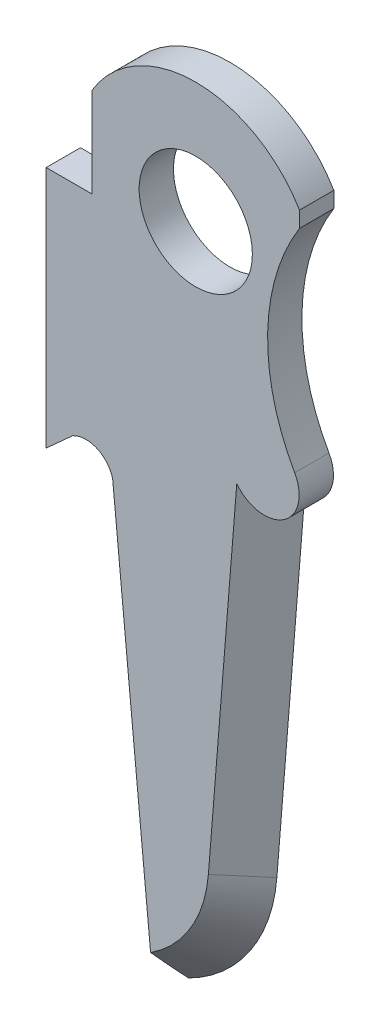
ISO-10303-21;
HEADER;
FILE_DESCRIPTION(('STEP AP214'),'2;1');
FILE_NAME('part.step','',(''),(''),'','','');
FILE_SCHEMA(('AUTOMOTIVE_DESIGN { 1 0 10303 214 1 1 1 1 }'));
ENDSEC;
DATA;
#1=APPLICATION_CONTEXT('core data for automotive mechanical design processes');
#2=APPLICATION_PROTOCOL_DEFINITION('international standard','automotive_design',2000,#1);
#3=PRODUCT_CONTEXT('',#1,'mechanical');
#4=PRODUCT('Part','Part','',(#3));
#5=PRODUCT_RELATED_PRODUCT_CATEGORY('part','',(#4));
#6=PRODUCT_DEFINITION_FORMATION('','',#4);
#7=PRODUCT_DEFINITION_CONTEXT('part definition',#1,'design');
#8=PRODUCT_DEFINITION('design','',#6,#7);
#9=PRODUCT_DEFINITION_SHAPE('','',#8);
#10=(LENGTH_UNIT() NAMED_UNIT(*) SI_UNIT(.MILLI.,.METRE.));
#11=(NAMED_UNIT(*) PLANE_ANGLE_UNIT() SI_UNIT($,.RADIAN.));
#12=(NAMED_UNIT(*) SI_UNIT($,.STERADIAN.) SOLID_ANGLE_UNIT());
#13=UNCERTAINTY_MEASURE_WITH_UNIT(LENGTH_MEASURE(1.E-05),#10,'distance_accuracy_value','');
#14=(GEOMETRIC_REPRESENTATION_CONTEXT(3) GLOBAL_UNCERTAINTY_ASSIGNED_CONTEXT((#13)) GLOBAL_UNIT_ASSIGNED_CONTEXT((#10,
#11,#12)) REPRESENTATION_CONTEXT('',''));
#15=CARTESIAN_POINT('',(0.,0.,0.));
#16=DIRECTION('',(0.,0.,1.));
#17=DIRECTION('',(1.,0.,0.));
#18=AXIS2_PLACEMENT_3D('',#15,#16,#17);
#19=CARTESIAN_POINT('',(41.3460783074005,38.2231152673054,1.27));
#20=DIRECTION('',(0.,-1.,0.));
#21=DIRECTION('',(0.,0.,-1.));
#22=AXIS2_PLACEMENT_3D('',#19,#20,#21);
#23=PLANE('',#22);
#24=DIRECTION('',(-1.,0.,0.));
#25=VECTOR('',#24,1.);
#26=CARTESIAN_POINT('',(41.3460783074005,38.2231152673054,0.));
#27=LINE('',#26,#25);
#28=CARTESIAN_POINT('',(43.0415755390958,38.2231152673054,0.));
#29=VERTEX_POINT('',#28);
#30=CARTESIAN_POINT('',(41.3460783074005,38.2231152673054,0.));
#31=VERTEX_POINT('',#30);
#32=EDGE_CURVE('E163',#29,#31,#27,.T.);
#33=ORIENTED_EDGE('',*,*,#32,.T.);
#34=DIRECTION('',(0.,0.,-1.));
#35=VECTOR('',#34,1.);
#36=CARTESIAN_POINT('',(41.3460783074005,38.2231152673054,1.27));
#37=LINE('',#36,#35);
#38=CARTESIAN_POINT('',(41.3460783074005,38.2231152673054,1.27));
#39=VERTEX_POINT('',#38);
#40=EDGE_CURVE('E141',#39,#31,#37,.T.);
#41=ORIENTED_EDGE('',*,*,#40,.F.);
#42=DIRECTION('',(-1.,0.,0.));
#43=VECTOR('',#42,1.);
#44=CARTESIAN_POINT('',(41.3460783074005,38.2231152673054,1.27));
#45=LINE('',#44,#43);
#46=CARTESIAN_POINT('',(43.0415755390958,38.2231152673054,1.27));
#47=VERTEX_POINT('',#46);
#48=EDGE_CURVE('E149',#47,#39,#45,.T.);
#49=ORIENTED_EDGE('',*,*,#48,.F.);
#50=DIRECTION('',(0.,0.,-1.));
#51=VECTOR('',#50,1.);
#52=CARTESIAN_POINT('',(43.0415755390958,38.2231152673054,1.27));
#53=LINE('',#52,#51);
#54=EDGE_CURVE('E391',#47,#29,#53,.T.);
#55=ORIENTED_EDGE('',*,*,#54,.T.);
#56=EDGE_LOOP('',(#33,#41,#49,#55));
#57=FACE_BOUND('',#56,.T.);
#58=ADVANCED_FACE('F45',(#57),#23,.F.);
#59=CARTESIAN_POINT('',(41.3460783074005,38.2231152673054,1.27));
#60=DIRECTION('',(1.,0.,0.));
#61=DIRECTION('',(0.,1.,0.));
#62=AXIS2_PLACEMENT_3D('',#59,#60,#61);
#63=PLANE('',#62);
#64=DIRECTION('',(0.,-1.,0.));
#65=VECTOR('',#64,1.);
#66=CARTESIAN_POINT('',(41.3460783074005,38.2231152673054,0.));
#67=LINE('',#66,#65);
#68=CARTESIAN_POINT('',(41.3460783074005,29.2269843527848,0.));
#69=VERTEX_POINT('',#68);
#70=EDGE_CURVE('E394',#31,#69,#67,.T.);
#71=ORIENTED_EDGE('',*,*,#70,.T.);
#72=DIRECTION('',(0.,0.,-1.));
#73=VECTOR('',#72,1.);
#74=CARTESIAN_POINT('',(41.3460783074005,29.2269843527848,1.27));
#75=LINE('',#74,#73);
#76=CARTESIAN_POINT('',(41.3460783074005,29.2269843527848,1.27));
#77=VERTEX_POINT('',#76);
#78=EDGE_CURVE('E144',#77,#69,#75,.T.);
#79=ORIENTED_EDGE('',*,*,#78,.F.);
#80=DIRECTION('',(0.,-1.,0.));
#81=VECTOR('',#80,1.);
#82=CARTESIAN_POINT('',(41.3460783074005,38.2231152673054,1.27));
#83=LINE('',#82,#81);
#84=EDGE_CURVE('E137',#39,#77,#83,.T.);
#85=ORIENTED_EDGE('',*,*,#84,.F.);
#86=ORIENTED_EDGE('',*,*,#40,.T.);
#87=EDGE_LOOP('',(#71,#79,#85,#86));
#88=FACE_BOUND('',#87,.T.);
#89=ADVANCED_FACE('F139',(#88),#63,.F.);
#90=CARTESIAN_POINT('',(41.3460783074005,29.2269843527848,1.27));
#91=DIRECTION('',(-0.671382027774461,0.74111144423862,0.));
#92=DIRECTION('',(-0.74111144423862,-0.671382027774461,0.));
#93=AXIS2_PLACEMENT_3D('',#90,#91,#92);
#94=PLANE('',#93);
#95=DIRECTION('',(0.74111144423862,0.671382027774461,0.));
#96=VECTOR('',#95,1.);
#97=CARTESIAN_POINT('',(41.3460783074005,29.2269843527848,0.));
#98=LINE('',#97,#96);
#99=CARTESIAN_POINT('',(42.3274094224322,30.1159843527848,0.));
#100=VERTEX_POINT('',#99);
#101=EDGE_CURVE('E398',#69,#100,#98,.T.);
#102=ORIENTED_EDGE('',*,*,#101,.T.);
#103=DIRECTION('',(0.,0.,-1.));
#104=VECTOR('',#103,1.);
#105=CARTESIAN_POINT('',(42.3274094224322,30.1159843527848,1.27));
#106=LINE('',#105,#104);
#107=CARTESIAN_POINT('',(42.3274094224322,30.1159843527848,1.27));
#108=VERTEX_POINT('',#107);
#109=EDGE_CURVE('E173',#108,#100,#106,.T.);
#110=ORIENTED_EDGE('',*,*,#109,.F.);
#111=DIRECTION('',(0.74111144423862,0.671382027774461,0.));
#112=VECTOR('',#111,1.);
#113=CARTESIAN_POINT('',(41.3460783074005,29.2269843527848,1.27));
#114=LINE('',#113,#112);
#115=EDGE_CURVE('E148',#77,#108,#114,.T.);
#116=ORIENTED_EDGE('',*,*,#115,.F.);
#117=ORIENTED_EDGE('',*,*,#78,.T.);
#118=EDGE_LOOP('',(#102,#110,#116,#117));
#119=FACE_BOUND('',#118,.T.);
#120=ADVANCED_FACE('F201',(#119),#94,.F.);
#121=CARTESIAN_POINT('',(42.8192783074005,29.2269843527848,1.27));
#122=DIRECTION('',(0.,0.,-1.));
#123=DIRECTION('',(-1.,0.,0.));
#124=AXIS2_PLACEMENT_3D('',#121,#122,#123);
#125=CYLINDRICAL_SURFACE('',#124,1.016);
#126=CARTESIAN_POINT('',(42.8192783074005,29.2269843527848,0.));
#127=DIRECTION('',(0.,0.,-1.));
#128=DIRECTION('',(1.,0.,0.));
#129=AXIS2_PLACEMENT_3D('',#126,#127,#128);
#130=CIRCLE('',#129,1.016);
#131=CARTESIAN_POINT('',(43.8092268111117,29.4555843527848,0.));
#132=VERTEX_POINT('',#131);
#133=EDGE_CURVE('E401',#100,#132,#130,.T.);
#134=ORIENTED_EDGE('',*,*,#133,.T.);
#135=DIRECTION('',(0.,0.,-1.));
#136=VECTOR('',#135,1.);
#137=CARTESIAN_POINT('',(43.8092268111117,29.4555843527848,1.27));
#138=LINE('',#137,#136);
#139=CARTESIAN_POINT('',(43.8092268111117,29.4555843527848,1.27));
#140=VERTEX_POINT('',#139);
#141=EDGE_CURVE('E443',#140,#132,#138,.T.);
#142=ORIENTED_EDGE('',*,*,#141,.F.);
#143=CARTESIAN_POINT('',(42.8192783074005,29.2269843527848,1.27));
#144=DIRECTION('',(0.,0.,-1.));
#145=DIRECTION('',(1.,0.,0.));
#146=AXIS2_PLACEMENT_3D('',#143,#144,#145);
#147=CIRCLE('',#146,1.016);
#148=EDGE_CURVE('E367',#108,#140,#147,.T.);
#149=ORIENTED_EDGE('',*,*,#148,.F.);
#150=ORIENTED_EDGE('',*,*,#109,.T.);
#151=EDGE_LOOP('',(#134,#142,#149,#150));
#152=FACE_BOUND('',#151,.T.);
#153=ADVANCED_FACE('F196',(#152),#125,.F.);
#154=CARTESIAN_POINT('',(43.8092268111117,29.4555843527848,1.27));
#155=DIRECTION('',(0.995332613976777,0.0965038214484582,0.));
#156=DIRECTION('',(-0.0965038214484582,0.995332613976777,0.));
#157=AXIS2_PLACEMENT_3D('',#154,#155,#156);
#158=PLANE('',#157);
#159=DIRECTION('',(0.0965038214484582,-0.995332613976777,0.));
#160=VECTOR('',#159,1.);
#161=CARTESIAN_POINT('',(43.8092268111117,29.4555843527848,0.));
#162=LINE('',#161,#160);
#163=CARTESIAN_POINT('',(45.3459462423361,13.6059843527848,0.));
#164=VERTEX_POINT('',#163);
#165=EDGE_CURVE('E365',#132,#164,#162,.T.);
#166=ORIENTED_EDGE('',*,*,#165,.T.);
#167=CARTESIAN_POINT('',(45.3459462423361,13.6059843527848,0.));
#168=CARTESIAN_POINT('',(45.3348717948386,13.7202053091223,0.107033345993553));
#169=CARTESIAN_POINT('',(45.3237772719997,13.8346333209082,0.213844561753811));
#170=CARTESIAN_POINT('',(45.30153921634,14.0639948294713,0.426909527932102));
#171=CARTESIAN_POINT('',(45.2903956852353,14.1789283085484,0.533163297589214));
#172=CARTESIAN_POINT('',(45.268049855891,14.4094013861837,0.745008848059013));
#173=CARTESIAN_POINT('',(45.256847556971,14.5249409917583,0.850600621177429));
#174=CARTESIAN_POINT('',(45.2343704710977,14.7567678386233,1.06096027584605));
#175=CARTESIAN_POINT('',(45.2230956816296,14.8730551058513,1.16572812852959));
#176=CARTESIAN_POINT('',(45.2117781123522,14.9897836005752,1.27000000000005));
#177=B_SPLINE_CURVE_WITH_KNOTS('',3,(#167,#168,#169,#170,#171,#172,#173,#174,#175,#176),
.UNSPECIFIED.,.F.,.F.,(4,2,2,2,4),(0.,0.470773200836895,0.941530045608354,1.41229235179922,
1.88307107866571),.UNSPECIFIED.);
#178=CARTESIAN_POINT('',(45.2117781123522,14.9897836005752,1.27));
#179=VERTEX_POINT('',#178);
#180=EDGE_CURVE('E56',#164,#179,#177,.T.);
#181=ORIENTED_EDGE('',*,*,#180,.T.);
#182=DIRECTION('',(0.0965038214484582,-0.995332613976777,0.));
#183=VECTOR('',#182,1.);
#184=CARTESIAN_POINT('',(43.8092268111117,29.4555843527848,1.27));
#185=LINE('',#184,#183);
#186=EDGE_CURVE('E363',#140,#179,#185,.T.);
#187=ORIENTED_EDGE('',*,*,#186,.F.);
#188=ORIENTED_EDGE('',*,*,#141,.T.);
#189=EDGE_LOOP('',(#166,#181,#187,#188));
#190=FACE_BOUND('',#189,.T.);
#191=ADVANCED_FACE('F190',(#190),#158,.F.);
#192=CARTESIAN_POINT('',(49.4232783074005,32.4019843527848,1.27));
#193=DIRECTION('',(0.,0.,-1.));
#194=DIRECTION('',(-1.,0.,0.));
#195=AXIS2_PLACEMENT_3D('',#192,#193,#194);
#196=CYLINDRICAL_SURFACE('',#195,1.28786868470081);
#197=CARTESIAN_POINT('',(49.4232783074005,32.4019843527848,0.));
#198=DIRECTION('',(0.,0.,1.));
#199=DIRECTION('',(1.,0.,0.));
#200=AXIS2_PLACEMENT_3D('',#197,#198,#199);
#201=CIRCLE('',#200,1.28786868470081);
#202=CARTESIAN_POINT('',(49.6370673366631,31.1319843527848,0.));
#203=VERTEX_POINT('',#202);
#204=CARTESIAN_POINT('',(50.5447856649619,33.0350933449565,0.));
#205=VERTEX_POINT('',#204);
#206=EDGE_CURVE('E412',#203,#205,#201,.T.);
#207=ORIENTED_EDGE('',*,*,#206,.T.);
#208=DIRECTION('',(0.,0.,-1.));
#209=VECTOR('',#208,1.);
#210=CARTESIAN_POINT('',(50.5447856649619,33.0350933449565,1.27));
#211=LINE('',#210,#209);
#212=CARTESIAN_POINT('',(50.5447856649619,33.0350933449565,1.27));
#213=VERTEX_POINT('',#212);
#214=EDGE_CURVE('E439',#213,#205,#211,.T.);
#215=ORIENTED_EDGE('',*,*,#214,.F.);
#216=CARTESIAN_POINT('',(49.4232783074005,32.4019843527848,1.27));
#217=DIRECTION('',(0.,0.,1.));
#218=DIRECTION('',(1.,0.,0.));
#219=AXIS2_PLACEMENT_3D('',#216,#217,#218);
#220=CIRCLE('',#219,1.28786868470081);
#221=CARTESIAN_POINT('',(48.4020421733455,31.6173299654693,1.27));
#222=VERTEX_POINT('',#221);
#223=EDGE_CURVE('E69',#222,#213,#220,.T.);
#224=ORIENTED_EDGE('',*,*,#223,.F.);
#225=CARTESIAN_POINT('',(49.4232783074005,32.4019843527848,0.315046533833206));
#226=DIRECTION('',(0.704824855730109,-0.0567619832725588,0.707106781186545));
#227=DIRECTION('',(0.704824855730105,-0.0567619832725585,-0.70710678118655));
#228=AXIS2_PLACEMENT_3D('',#225,#226,#227);
#229=ELLIPSE('',#228,1.82132136045949,1.28786868470081);
#230=EDGE_CURVE('E11',#222,#203,#229,.T.);
#231=ORIENTED_EDGE('',*,*,#230,.T.);
#232=EDGE_LOOP('',(#207,#215,#224,#231));
#233=FACE_BOUND('',#232,.T.);
#234=ADVANCED_FACE('F195',(#233),#196,.T.);
#235=CARTESIAN_POINT('',(57.2972783074005,36.8469843527848,1.27));
#236=DIRECTION('',(0.,0.,-1.));
#237=DIRECTION('',(-1.,0.,0.));
#238=AXIS2_PLACEMENT_3D('',#235,#236,#237);
#239=CYLINDRICAL_SURFACE('',#238,7.75413889105358);
#240=CARTESIAN_POINT('',(57.2972783074005,36.8469843527848,0.));
#241=DIRECTION('',(0.,0.,-1.));
#242=DIRECTION('',(1.,0.,0.));
#243=AXIS2_PLACEMENT_3D('',#240,#241,#242);
#244=CIRCLE('',#243,7.75413889105358);
#245=CARTESIAN_POINT('',(50.7249810757052,40.9617843527848,0.));
#246=VERTEX_POINT('',#245);
#247=EDGE_CURVE('E415',#205,#246,#244,.T.);
#248=ORIENTED_EDGE('',*,*,#247,.T.);
#249=DIRECTION('',(0.,0.,-1.));
#250=VECTOR('',#249,1.);
#251=CARTESIAN_POINT('',(50.7249810757052,40.9617843527848,1.27));
#252=LINE('',#251,#250);
#253=CARTESIAN_POINT('',(50.7249810757052,40.9617843527848,1.27));
#254=VERTEX_POINT('',#253);
#255=EDGE_CURVE('E435',#254,#246,#252,.T.);
#256=ORIENTED_EDGE('',*,*,#255,.F.);
#257=CARTESIAN_POINT('',(57.2972783074005,36.8469843527848,1.27));
#258=DIRECTION('',(0.,0.,-1.));
#259=DIRECTION('',(1.,0.,0.));
#260=AXIS2_PLACEMENT_3D('',#257,#258,#259);
#261=CIRCLE('',#260,7.75413889105358);
#262=EDGE_CURVE('E376',#213,#254,#261,.T.);
#263=ORIENTED_EDGE('',*,*,#262,.F.);
#264=ORIENTED_EDGE('',*,*,#214,.T.);
#265=EDGE_LOOP('',(#248,#256,#263,#264));
#266=FACE_BOUND('',#265,.T.);
#267=ADVANCED_FACE('F234',(#266),#239,.F.);
#268=CARTESIAN_POINT('',(50.7249810757052,41.5459843527848,1.27));
#269=DIRECTION('',(-1.,0.,0.));
#270=DIRECTION('',(0.,0.,1.));
#271=AXIS2_PLACEMENT_3D('',#268,#269,#270);
#272=PLANE('',#271);
#273=DIRECTION('',(0.,1.,0.));
#274=VECTOR('',#273,1.);
#275=CARTESIAN_POINT('',(50.7249810757052,41.5459843527848,0.));
#276=LINE('',#275,#274);
#277=CARTESIAN_POINT('',(50.7249810757052,41.5459843527848,0.));
#278=VERTEX_POINT('',#277);
#279=EDGE_CURVE('E418',#246,#278,#276,.T.);
#280=ORIENTED_EDGE('',*,*,#279,.T.);
#281=DIRECTION('',(0.,0.,-1.));
#282=VECTOR('',#281,1.);
#283=CARTESIAN_POINT('',(50.7249810757052,41.5459843527848,1.27));
#284=LINE('',#283,#282);
#285=CARTESIAN_POINT('',(50.7249810757052,41.5459843527848,1.27));
#286=VERTEX_POINT('',#285);
#287=EDGE_CURVE('E431',#286,#278,#284,.T.);
#288=ORIENTED_EDGE('',*,*,#287,.F.);
#289=DIRECTION('',(0.,1.,0.));
#290=VECTOR('',#289,1.);
#291=CARTESIAN_POINT('',(50.7249810757052,41.5459843527848,1.27));
#292=LINE('',#291,#290);
#293=EDGE_CURVE('E384',#254,#286,#292,.T.);
#294=ORIENTED_EDGE('',*,*,#293,.F.);
#295=ORIENTED_EDGE('',*,*,#255,.T.);
#296=EDGE_LOOP('',(#280,#288,#294,#295));
#297=FACE_BOUND('',#296,.T.);
#298=ADVANCED_FACE('F240',(#297),#272,.F.);
#299=CARTESIAN_POINT('',(46.8832783074005,39.2599843527848,1.27));
#300=DIRECTION('',(0.,0.,-1.));
#301=DIRECTION('',(-1.,0.,0.));
#302=AXIS2_PLACEMENT_3D('',#299,#300,#301);
#303=CYLINDRICAL_SURFACE('',#302,4.4704);
#304=CARTESIAN_POINT('',(46.8832783074005,39.2599843527848,0.));
#305=DIRECTION('',(0.,0.,1.));
#306=DIRECTION('',(1.,0.,0.));
#307=AXIS2_PLACEMENT_3D('',#304,#305,#306);
#308=CIRCLE('',#307,4.4704);
#309=CARTESIAN_POINT('',(43.0415755390958,41.5459843527848,0.));
#310=VERTEX_POINT('',#309);
#311=EDGE_CURVE('E420',#278,#310,#308,.T.);
#312=ORIENTED_EDGE('',*,*,#311,.T.);
#313=DIRECTION('',(0.,0.,-1.));
#314=VECTOR('',#313,1.);
#315=CARTESIAN_POINT('',(43.0415755390958,41.5459843527848,1.27));
#316=LINE('',#315,#314);
#317=CARTESIAN_POINT('',(43.0415755390958,41.5459843527848,1.27));
#318=VERTEX_POINT('',#317);
#319=EDGE_CURVE('E427',#318,#310,#316,.T.);
#320=ORIENTED_EDGE('',*,*,#319,.F.);
#321=CARTESIAN_POINT('',(46.8832783074005,39.2599843527848,1.27));
#322=DIRECTION('',(0.,0.,1.));
#323=DIRECTION('',(1.,0.,0.));
#324=AXIS2_PLACEMENT_3D('',#321,#322,#323);
#325=CIRCLE('',#324,4.4704);
#326=EDGE_CURVE('E386',#286,#318,#325,.T.);
#327=ORIENTED_EDGE('',*,*,#326,.F.);
#328=ORIENTED_EDGE('',*,*,#287,.T.);
#329=EDGE_LOOP('',(#312,#320,#327,#328));
#330=FACE_BOUND('',#329,.T.);
#331=ADVANCED_FACE('F247',(#330),#303,.T.);
#332=CARTESIAN_POINT('',(43.0415755390958,38.2231152673054,1.27));
#333=DIRECTION('',(1.,0.,0.));
#334=DIRECTION('',(0.,0.,-1.));
#335=AXIS2_PLACEMENT_3D('',#332,#333,#334);
#336=PLANE('',#335);
#337=DIRECTION('',(0.,-1.,0.));
#338=VECTOR('',#337,1.);
#339=CARTESIAN_POINT('',(43.0415755390958,38.2231152673054,0.));
#340=LINE('',#339,#338);
#341=EDGE_CURVE('E160',#310,#29,#340,.T.);
#342=ORIENTED_EDGE('',*,*,#341,.T.);
#343=ORIENTED_EDGE('',*,*,#54,.F.);
#344=DIRECTION('',(0.,-1.,0.));
#345=VECTOR('',#344,1.);
#346=CARTESIAN_POINT('',(43.0415755390958,38.2231152673054,1.27));
#347=LINE('',#346,#345);
#348=EDGE_CURVE('E155',#318,#47,#347,.T.);
#349=ORIENTED_EDGE('',*,*,#348,.F.);
#350=ORIENTED_EDGE('',*,*,#319,.T.);
#351=EDGE_LOOP('',(#342,#343,#349,#350));
#352=FACE_BOUND('',#351,.T.);
#353=ADVANCED_FACE('F254',(#352),#336,.F.);
#354=CARTESIAN_POINT('',(46.8832783074005,39.2599843527848,1.27));
#355=DIRECTION('',(0.,0.,1.));
#356=DIRECTION('',(1.,0.,0.));
#357=AXIS2_PLACEMENT_3D('',#354,#355,#356);
#358=PLANE('',#357);
#359=CARTESIAN_POINT('',(46.8832783074005,39.2599843527848,1.27));
#360=DIRECTION('',(0.,0.,1.));
#361=DIRECTION('',(1.,0.,0.));
#362=AXIS2_PLACEMENT_3D('',#359,#360,#361);
#363=CIRCLE('',#362,2.0955);
#364=CARTESIAN_POINT('',(48.9787783074005,39.2599843527848,1.27));
#365=VERTEX_POINT('',#364);
#366=EDGE_CURVE('E457',#365,#365,#363,.T.);
#367=ORIENTED_EDGE('',*,*,#366,.F.);
#368=EDGE_LOOP('',(#367));
#369=FACE_BOUND('',#368,.T.);
#370=ORIENTED_EDGE('',*,*,#186,.T.);
#371=CARTESIAN_POINT('',(42.6668783074005,18.9399843527848,1.27));
#372=DIRECTION('',(0.,0.,1.));
#373=DIRECTION('',(1.,0.,0.));
#374=AXIS2_PLACEMENT_3D('',#371,#372,#373);
#375=CIRCLE('',#374,4.69899999999999);
#376=CARTESIAN_POINT('',(47.350714023865,18.5627788634665,1.27));
#377=VERTEX_POINT('',#376);
#378=EDGE_CURVE('E171',#179,#377,#375,.T.);
#379=ORIENTED_EDGE('',*,*,#378,.T.);
#380=DIRECTION('',(0.0802735665712472,0.996772870071177,0.));
#381=VECTOR('',#380,1.);
#382=CARTESIAN_POINT('',(48.3711657916727,31.2339317823303,1.27));
#383=LINE('',#382,#381);
#384=EDGE_CURVE('E165',#377,#222,#383,.T.);
#385=ORIENTED_EDGE('',*,*,#384,.T.);
#386=ORIENTED_EDGE('',*,*,#223,.T.);
#387=ORIENTED_EDGE('',*,*,#262,.T.);
#388=ORIENTED_EDGE('',*,*,#293,.T.);
#389=ORIENTED_EDGE('',*,*,#326,.T.);
#390=ORIENTED_EDGE('',*,*,#348,.T.);
#391=ORIENTED_EDGE('',*,*,#48,.T.);
#392=ORIENTED_EDGE('',*,*,#84,.T.);
#393=ORIENTED_EDGE('',*,*,#115,.T.);
#394=ORIENTED_EDGE('',*,*,#148,.T.);
#395=EDGE_LOOP('',(#370,#379,#385,#386,#387,#388,#389,#390,#391,#392,#393,#394));
#396=FACE_BOUND('',#395,.T.);
#397=ADVANCED_FACE('F153',(#369,#396),#358,.T.);
#398=CARTESIAN_POINT('',(46.8832783074005,39.2599843527848,0.));
#399=DIRECTION('',(0.,0.,1.));
#400=DIRECTION('',(1.,0.,0.));
#401=AXIS2_PLACEMENT_3D('',#398,#399,#400);
#402=PLANE('',#401);
#403=CARTESIAN_POINT('',(46.8832783074005,39.2599843527848,0.));
#404=DIRECTION('',(0.,0.,1.));
#405=DIRECTION('',(1.,0.,0.));
#406=AXIS2_PLACEMENT_3D('',#403,#404,#405);
#407=CIRCLE('',#406,2.0955);
#408=CARTESIAN_POINT('',(48.9787783074005,39.2599843527848,0.));
#409=VERTEX_POINT('',#408);
#410=EDGE_CURVE('E395',#409,#409,#407,.T.);
#411=ORIENTED_EDGE('',*,*,#410,.T.);
#412=EDGE_LOOP('',(#411));
#413=FACE_BOUND('',#412,.T.);
#414=ORIENTED_EDGE('',*,*,#32,.F.);
#415=ORIENTED_EDGE('',*,*,#341,.F.);
#416=ORIENTED_EDGE('',*,*,#311,.F.);
#417=ORIENTED_EDGE('',*,*,#279,.F.);
#418=ORIENTED_EDGE('',*,*,#247,.F.);
#419=ORIENTED_EDGE('',*,*,#206,.F.);
#420=DIRECTION('',(0.0802735665712472,0.996772870071177,0.));
#421=VECTOR('',#420,1.);
#422=CARTESIAN_POINT('',(49.6370673366631,31.1319843527848,0.));
#423=LINE('',#422,#421);
#424=CARTESIAN_POINT('',(48.6166155688554,18.460831433921,0.));
#425=VERTEX_POINT('',#424);
#426=EDGE_CURVE('E408',#425,#203,#423,.T.);
#427=ORIENTED_EDGE('',*,*,#426,.F.);
#428=CARTESIAN_POINT('',(42.6668783074005,18.9399843527848,0.));
#429=DIRECTION('',(0.,0.,1.));
#430=DIRECTION('',(1.,0.,0.));
#431=AXIS2_PLACEMENT_3D('',#428,#429,#430);
#432=CIRCLE('',#431,5.96899999999999);
#433=EDGE_CURVE('E360',#164,#425,#432,.T.);
#434=ORIENTED_EDGE('',*,*,#433,.F.);
#435=ORIENTED_EDGE('',*,*,#165,.F.);
#436=ORIENTED_EDGE('',*,*,#133,.F.);
#437=ORIENTED_EDGE('',*,*,#101,.F.);
#438=ORIENTED_EDGE('',*,*,#70,.F.);
#439=EDGE_LOOP('',(#414,#415,#416,#417,#418,#419,#427,#434,#435,#436,#437,#438));
#440=FACE_BOUND('',#439,.T.);
#441=ADVANCED_FACE('F269',(#413,#440),#402,.F.);
#442=CARTESIAN_POINT('',(46.8832783074005,39.2599843527848,0.));
#443=DIRECTION('',(0.,0.,1.));
#444=DIRECTION('',(1.,0.,0.));
#445=AXIS2_PLACEMENT_3D('',#442,#443,#444);
#446=CYLINDRICAL_SURFACE('',#445,2.0955);
#447=ORIENTED_EDGE('',*,*,#410,.F.);
#448=EDGE_LOOP('',(#447));
#449=FACE_BOUND('',#448,.T.);
#450=ORIENTED_EDGE('',*,*,#366,.T.);
#451=EDGE_LOOP('',(#450));
#452=FACE_BOUND('',#451,.T.);
#453=ADVANCED_FACE('F277',(#449,#452),#446,.F.);
#454=CARTESIAN_POINT('',(49.0037787651002,39.0892131171638,1.27));
#455=DIRECTION('',(0.704824855730109,-0.0567619832725588,0.707106781186545));
#456=DIRECTION('',(-0.0802735665712472,-0.996772870071177,0.));
#457=AXIS2_PLACEMENT_3D('',#454,#455,#456);
#458=PLANE('',#457);
#459=ORIENTED_EDGE('',*,*,#230,.F.);
#460=ORIENTED_EDGE('',*,*,#384,.F.);
#461=DIRECTION('',(-0.704824855730104,0.0567619832725586,0.70710678118655));
#462=VECTOR('',#461,1.);
#463=CARTESIAN_POINT('',(48.6166155688554,18.460831433921,0.));
#464=LINE('',#463,#462);
#465=EDGE_CURVE('E50',#425,#377,#464,.T.);
#466=ORIENTED_EDGE('',*,*,#465,.F.);
#467=ORIENTED_EDGE('',*,*,#426,.T.);
#468=EDGE_LOOP('',(#459,#460,#466,#467));
#469=FACE_BOUND('',#468,.T.);
#470=ADVANCED_FACE('F48',(#469),#458,.T.);
#471=CARTESIAN_POINT('',(42.6668783074005,18.9399843527848,1.27));
#472=DIRECTION('',(0.,0.,-1.));
#473=DIRECTION('',(-1.,0.,0.));
#474=AXIS2_PLACEMENT_3D('',#471,#472,#473);
#475=CONICAL_SURFACE('',#474,4.69899999999999,0.785398163397446);
#476=ORIENTED_EDGE('',*,*,#180,.F.);
#477=ORIENTED_EDGE('',*,*,#433,.T.);
#478=ORIENTED_EDGE('',*,*,#465,.T.);
#479=ORIENTED_EDGE('',*,*,#378,.F.);
#480=EDGE_LOOP('',(#476,#477,#478,#479));
#481=FACE_BOUND('',#480,.T.);
#482=ADVANCED_FACE('F187',(#481),#475,.T.);
#483=CLOSED_SHELL('',(#58,#89,#120,#153,#191,#234,#267,#298,#331,#353,#397,#441,#453,#470,#482));
#484=MANIFOLD_SOLID_BREP('B2',#483);
#485=ADVANCED_BREP_SHAPE_REPRESENTATION('',(#18,#484),#14);
#486=SHAPE_DEFINITION_REPRESENTATION(#9,#485);
ENDSEC;
END-ISO-10303-21;
